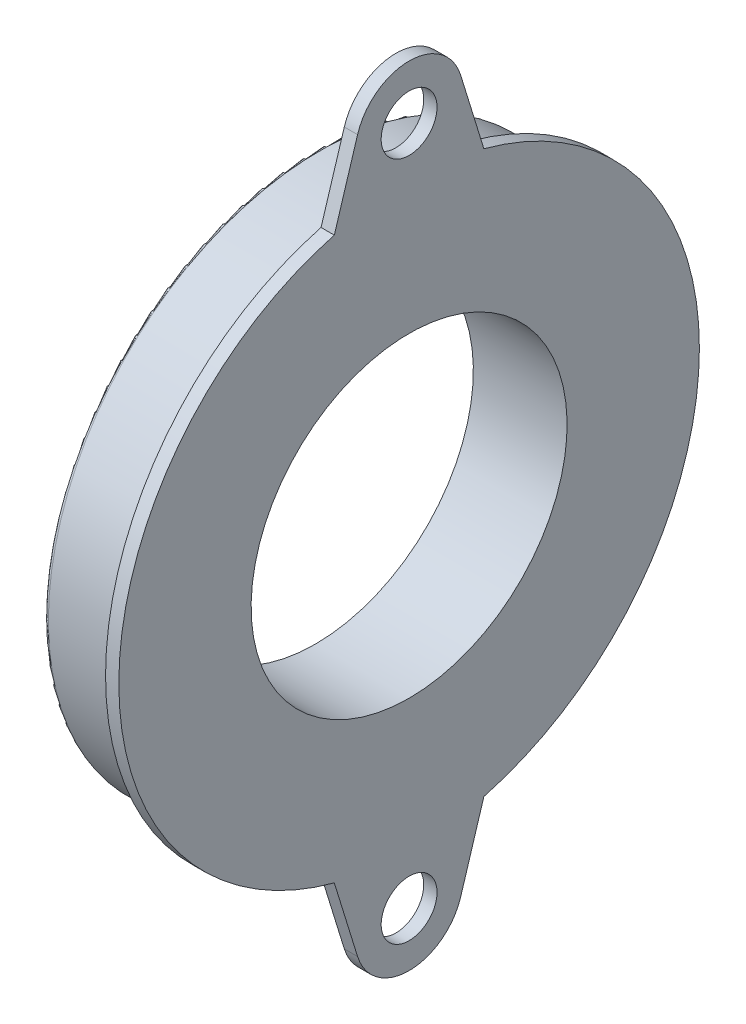
ISO-10303-21;
HEADER;
FILE_DESCRIPTION(('STEP AP214'),'2;1');
FILE_NAME('part.step','',(''),(''),'','','');
FILE_SCHEMA(('AUTOMOTIVE_DESIGN { 1 0 10303 214 1 1 1 1 }'));
ENDSEC;
DATA;
#1=APPLICATION_CONTEXT('core data for automotive mechanical design processes');
#2=APPLICATION_PROTOCOL_DEFINITION('international standard','automotive_design',2000,#1);
#3=PRODUCT_CONTEXT('',#1,'mechanical');
#4=PRODUCT('Part','Part','',(#3));
#5=PRODUCT_RELATED_PRODUCT_CATEGORY('part','',(#4));
#6=PRODUCT_DEFINITION_FORMATION('','',#4);
#7=PRODUCT_DEFINITION_CONTEXT('part definition',#1,'design');
#8=PRODUCT_DEFINITION('design','',#6,#7);
#9=PRODUCT_DEFINITION_SHAPE('','',#8);
#10=(LENGTH_UNIT() NAMED_UNIT(*) SI_UNIT(.MILLI.,.METRE.));
#11=(NAMED_UNIT(*) PLANE_ANGLE_UNIT() SI_UNIT($,.RADIAN.));
#12=(NAMED_UNIT(*) SI_UNIT($,.STERADIAN.) SOLID_ANGLE_UNIT());
#13=UNCERTAINTY_MEASURE_WITH_UNIT(LENGTH_MEASURE(1.E-05),#10,'distance_accuracy_value','');
#14=(GEOMETRIC_REPRESENTATION_CONTEXT(3) GLOBAL_UNCERTAINTY_ASSIGNED_CONTEXT((#13)) GLOBAL_UNIT_ASSIGNED_CONTEXT((#10,
#11,#12)) REPRESENTATION_CONTEXT('',''));
#15=CARTESIAN_POINT('',(0.,0.,0.));
#16=DIRECTION('',(0.,0.,1.));
#17=DIRECTION('',(1.,0.,0.));
#18=AXIS2_PLACEMENT_3D('',#15,#16,#17);
#19=CARTESIAN_POINT('',(-166.7002,-94.8054117549614,1701.53821105677));
#20=DIRECTION('',(0.,-0.294643766699233,0.955607163402037));
#21=DIRECTION('',(0.,-0.955607163402037,-0.294643766699233));
#22=AXIS2_PLACEMENT_3D('',#19,#20,#21);
#23=PLANE('',#22);
#24=DIRECTION('',(0.,-0.955607163402037,-0.294643766699233));
#25=VECTOR('',#24,1.);
#26=CARTESIAN_POINT('',(-165.1,-94.8054117549614,1701.53821105677));
#27=LINE('',#26,#25);
#28=CARTESIAN_POINT('',(-165.1,-33.8197828561924,1720.342));
#29=VERTEX_POINT('',#28);
#30=CARTESIAN_POINT('',(-165.1,-42.911491628585,1717.5387400193));
#31=VERTEX_POINT('',#30);
#32=EDGE_CURVE('E248',#29,#31,#27,.T.);
#33=ORIENTED_EDGE('',*,*,#32,.F.);
#34=DIRECTION('',(1.,0.,0.));
#35=VECTOR('',#34,1.);
#36=CARTESIAN_POINT('',(-166.7002,-33.8197828561924,1720.342));
#37=LINE('',#36,#35);
#38=CARTESIAN_POINT('',(-166.7002,-33.8197828561924,1720.342));
#39=VERTEX_POINT('',#38);
#40=EDGE_CURVE('E86',#39,#29,#37,.T.);
#41=ORIENTED_EDGE('',*,*,#40,.F.);
#42=DIRECTION('',(0.,-0.955607163402037,-0.294643766699233));
#43=VECTOR('',#42,1.);
#44=CARTESIAN_POINT('',(-166.7002,-94.8054117549614,1701.53821105677));
#45=LINE('',#44,#43);
#46=CARTESIAN_POINT('',(-166.7002,-42.911491628585,1717.5387400193));
#47=VERTEX_POINT('',#46);
#48=EDGE_CURVE('E256',#39,#47,#45,.T.);
#49=ORIENTED_EDGE('',*,*,#48,.T.);
#50=DIRECTION('',(1.,0.,0.));
#51=VECTOR('',#50,1.);
#52=CARTESIAN_POINT('',(-166.7002,-42.911491628585,1717.5387400193));
#53=LINE('',#52,#51);
#54=EDGE_CURVE('E39',#47,#31,#53,.T.);
#55=ORIENTED_EDGE('',*,*,#54,.T.);
#56=EDGE_LOOP('',(#33,#41,#49,#55));
#57=FACE_BOUND('',#56,.T.);
#58=ADVANCED_FACE('F16',(#57),#23,.T.);
#59=CARTESIAN_POINT('',(-166.7002,0.,1711.325));
#60=DIRECTION('',(1.,0.,0.));
#61=DIRECTION('',(0.,0.,-1.));
#62=AXIS2_PLACEMENT_3D('',#59,#60,#61);
#63=CYLINDRICAL_SURFACE('',#62,35.0012);
#64=CARTESIAN_POINT('',(-165.1,0.,1711.325));
#65=DIRECTION('',(-1.,0.,0.));
#66=DIRECTION('',(0.,-0.966246381729549,0.257619738751816));
#67=AXIS2_PLACEMENT_3D('',#64,#65,#66);
#68=CIRCLE('',#67,35.0012);
#69=CARTESIAN_POINT('',(-165.1,33.8197828561922,1720.342));
#70=VERTEX_POINT('',#69);
#71=EDGE_CURVE('E277',#29,#70,#68,.T.);
#72=ORIENTED_EDGE('',*,*,#71,.T.);
#73=DIRECTION('',(1.,0.,0.));
#74=VECTOR('',#73,1.);
#75=CARTESIAN_POINT('',(-166.7002,33.8197828561922,1720.342));
#76=LINE('',#75,#74);
#77=CARTESIAN_POINT('',(-166.7002,33.8197828561922,1720.342));
#78=VERTEX_POINT('',#77);
#79=EDGE_CURVE('E149',#78,#70,#76,.T.);
#80=ORIENTED_EDGE('',*,*,#79,.F.);
#81=CARTESIAN_POINT('',(-166.7002,0.,1711.325));
#82=DIRECTION('',(-1.,0.,0.));
#83=DIRECTION('',(0.,-0.966246381729549,0.257619738751816));
#84=AXIS2_PLACEMENT_3D('',#81,#82,#83);
#85=CIRCLE('',#84,35.0012);
#86=EDGE_CURVE('E260',#39,#78,#85,.T.);
#87=ORIENTED_EDGE('',*,*,#86,.F.);
#88=ORIENTED_EDGE('',*,*,#40,.T.);
#89=EDGE_LOOP('',(#72,#80,#87,#88));
#90=FACE_BOUND('',#89,.T.);
#91=ADVANCED_FACE('F186',(#90),#63,.T.);
#92=CARTESIAN_POINT('',(-166.7002,38.4856338406995,1718.90337128144));
#93=DIRECTION('',(0.,-0.294643766699233,-0.955607163402037));
#94=DIRECTION('',(0.,0.955607163402037,-0.294643766699233));
#95=AXIS2_PLACEMENT_3D('',#92,#93,#94);
#96=PLANE('',#95);
#97=DIRECTION('',(0.,0.955607163402037,-0.294643766699233));
#98=VECTOR('',#97,1.);
#99=CARTESIAN_POINT('',(-165.1,38.4856338406995,1718.90337128144));
#100=LINE('',#99,#98);
#101=CARTESIAN_POINT('',(-165.1,42.911491628585,1717.5387400193));
#102=VERTEX_POINT('',#101);
#103=EDGE_CURVE('E281',#70,#102,#100,.T.);
#104=ORIENTED_EDGE('',*,*,#103,.T.);
#105=DIRECTION('',(1.,0.,0.));
#106=VECTOR('',#105,1.);
#107=CARTESIAN_POINT('',(-166.7002,42.911491628585,1717.5387400193));
#108=LINE('',#107,#106);
#109=CARTESIAN_POINT('',(-166.7002,42.911491628585,1717.5387400193));
#110=VERTEX_POINT('',#109);
#111=EDGE_CURVE('E146',#110,#102,#108,.T.);
#112=ORIENTED_EDGE('',*,*,#111,.F.);
#113=DIRECTION('',(0.,0.955607163402037,-0.294643766699233));
#114=VECTOR('',#113,1.);
#115=CARTESIAN_POINT('',(-166.7002,38.4856338406995,1718.90337128144));
#116=LINE('',#115,#114);
#117=EDGE_CURVE('E264',#78,#110,#116,.T.);
#118=ORIENTED_EDGE('',*,*,#117,.F.);
#119=ORIENTED_EDGE('',*,*,#79,.T.);
#120=EDGE_LOOP('',(#104,#112,#118,#119));
#121=FACE_BOUND('',#120,.T.);
#122=ADVANCED_FACE('F190',(#121),#96,.F.);
#123=CARTESIAN_POINT('',(-166.7002,40.9956,1711.325));
#124=DIRECTION('',(1.,0.,0.));
#125=DIRECTION('',(0.,0.,-1.));
#126=AXIS2_PLACEMENT_3D('',#123,#124,#125);
#127=CYLINDRICAL_SURFACE('',#126,6.5024);
#128=CARTESIAN_POINT('',(-165.1,40.9956,1711.325));
#129=DIRECTION('',(-1.,0.,0.));
#130=DIRECTION('',(0.,0.294643766699231,0.955607163402038));
#131=AXIS2_PLACEMENT_3D('',#128,#129,#130);
#132=CIRCLE('',#131,6.5024);
#133=CARTESIAN_POINT('',(-165.1,42.911491628585,1705.11125998069));
#134=VERTEX_POINT('',#133);
#135=EDGE_CURVE('E285',#102,#134,#132,.T.);
#136=ORIENTED_EDGE('',*,*,#135,.T.);
#137=DIRECTION('',(1.,0.,0.));
#138=VECTOR('',#137,1.);
#139=CARTESIAN_POINT('',(-166.7002,42.911491628585,1705.11125998069));
#140=LINE('',#139,#138);
#141=CARTESIAN_POINT('',(-166.7002,42.911491628585,1705.11125998069));
#142=VERTEX_POINT('',#141);
#143=EDGE_CURVE('E138',#142,#134,#140,.T.);
#144=ORIENTED_EDGE('',*,*,#143,.F.);
#145=CARTESIAN_POINT('',(-166.7002,40.9956,1711.325));
#146=DIRECTION('',(-1.,0.,0.));
#147=DIRECTION('',(0.,0.294643766699231,0.955607163402038));
#148=AXIS2_PLACEMENT_3D('',#145,#146,#147);
#149=CIRCLE('',#148,6.5024);
#150=EDGE_CURVE('E268',#110,#142,#149,.T.);
#151=ORIENTED_EDGE('',*,*,#150,.F.);
#152=ORIENTED_EDGE('',*,*,#111,.T.);
#153=EDGE_LOOP('',(#136,#144,#151,#152));
#154=FACE_BOUND('',#153,.T.);
#155=ADVANCED_FACE('F196',(#154),#127,.T.);
#156=CARTESIAN_POINT('',(-166.7002,36.776257612061,1703.21957422379));
#157=DIRECTION('',(0.,0.29464376669919,-0.95560716340205));
#158=DIRECTION('',(0.,0.95560716340205,0.29464376669919));
#159=AXIS2_PLACEMENT_3D('',#156,#157,#158);
#160=PLANE('',#159);
#161=DIRECTION('',(0.,0.95560716340205,0.29464376669919));
#162=VECTOR('',#161,1.);
#163=CARTESIAN_POINT('',(-165.1,36.776257612061,1703.21957422379));
#164=LINE('',#163,#162);
#165=CARTESIAN_POINT('',(-165.1,33.8197828561923,1702.308));
#166=VERTEX_POINT('',#165);
#167=EDGE_CURVE('E289',#166,#134,#164,.T.);
#168=ORIENTED_EDGE('',*,*,#167,.F.);
#169=DIRECTION('',(1.,0.,0.));
#170=VECTOR('',#169,1.);
#171=CARTESIAN_POINT('',(-166.7002,33.8197828561923,1702.308));
#172=LINE('',#171,#170);
#173=CARTESIAN_POINT('',(-166.7002,33.8197828561923,1702.308));
#174=VERTEX_POINT('',#173);
#175=EDGE_CURVE('E133',#174,#166,#172,.T.);
#176=ORIENTED_EDGE('',*,*,#175,.F.);
#177=DIRECTION('',(0.,0.95560716340205,0.29464376669919));
#178=VECTOR('',#177,1.);
#179=CARTESIAN_POINT('',(-166.7002,36.776257612061,1703.21957422379));
#180=LINE('',#179,#178);
#181=EDGE_CURVE('E125',#174,#142,#180,.T.);
#182=ORIENTED_EDGE('',*,*,#181,.T.);
#183=ORIENTED_EDGE('',*,*,#143,.T.);
#184=EDGE_LOOP('',(#168,#176,#182,#183));
#185=FACE_BOUND('',#184,.T.);
#186=ADVANCED_FACE('F200',(#185),#160,.T.);
#187=CARTESIAN_POINT('',(-166.7002,0.,1711.325));
#188=DIRECTION('',(1.,0.,0.));
#189=DIRECTION('',(0.,0.,-1.));
#190=AXIS2_PLACEMENT_3D('',#187,#188,#189);
#191=CYLINDRICAL_SURFACE('',#190,35.0012);
#192=CARTESIAN_POINT('',(-165.1,0.,1711.325));
#193=DIRECTION('',(-1.,0.,0.));
#194=DIRECTION('',(0.,0.96624638172955,-0.257619738751815));
#195=AXIS2_PLACEMENT_3D('',#192,#193,#194);
#196=CIRCLE('',#195,35.0012);
#197=CARTESIAN_POINT('',(-165.1,-33.8197828561924,1702.308));
#198=VERTEX_POINT('',#197);
#199=EDGE_CURVE('E131',#166,#198,#196,.T.);
#200=ORIENTED_EDGE('',*,*,#199,.T.);
#201=DIRECTION('',(1.,0.,0.));
#202=VECTOR('',#201,1.);
#203=CARTESIAN_POINT('',(-166.7002,-33.8197828561924,1702.308));
#204=LINE('',#203,#202);
#205=CARTESIAN_POINT('',(-166.7002,-33.8197828561924,1702.308));
#206=VERTEX_POINT('',#205);
#207=EDGE_CURVE('E112',#206,#198,#204,.T.);
#208=ORIENTED_EDGE('',*,*,#207,.F.);
#209=CARTESIAN_POINT('',(-166.7002,0.,1711.325));
#210=DIRECTION('',(-1.,0.,0.));
#211=DIRECTION('',(0.,0.96624638172955,-0.257619738751815));
#212=AXIS2_PLACEMENT_3D('',#209,#210,#211);
#213=CIRCLE('',#212,35.0012);
#214=EDGE_CURVE('E118',#174,#206,#213,.T.);
#215=ORIENTED_EDGE('',*,*,#214,.F.);
#216=ORIENTED_EDGE('',*,*,#175,.T.);
#217=EDGE_LOOP('',(#200,#208,#215,#216));
#218=FACE_BOUND('',#217,.T.);
#219=ADVANCED_FACE('F129',(#218),#191,.T.);
#220=CARTESIAN_POINT('',(-166.7002,19.5435203021932,1685.85441399911));
#221=DIRECTION('',(0.,0.29464376669919,0.95560716340205));
#222=DIRECTION('',(0.,-0.95560716340205,0.29464376669919));
#223=AXIS2_PLACEMENT_3D('',#220,#221,#222);
#224=PLANE('',#223);
#225=DIRECTION('',(0.,-0.95560716340205,0.29464376669919));
#226=VECTOR('',#225,1.);
#227=CARTESIAN_POINT('',(-165.1,19.5435203021932,1685.85441399911));
#228=LINE('',#227,#226);
#229=CARTESIAN_POINT('',(-165.1,-42.911491628585,1705.11125998069));
#230=VERTEX_POINT('',#229);
#231=EDGE_CURVE('E295',#198,#230,#228,.T.);
#232=ORIENTED_EDGE('',*,*,#231,.T.);
#233=DIRECTION('',(1.,0.,0.));
#234=VECTOR('',#233,1.);
#235=CARTESIAN_POINT('',(-166.7002,-42.911491628585,1705.11125998069));
#236=LINE('',#235,#234);
#237=CARTESIAN_POINT('',(-166.7002,-42.911491628585,1705.11125998069));
#238=VERTEX_POINT('',#237);
#239=EDGE_CURVE('E74',#238,#230,#236,.T.);
#240=ORIENTED_EDGE('',*,*,#239,.F.);
#241=DIRECTION('',(0.,-0.95560716340205,0.29464376669919));
#242=VECTOR('',#241,1.);
#243=CARTESIAN_POINT('',(-166.7002,19.5435203021932,1685.85441399911));
#244=LINE('',#243,#242);
#245=EDGE_CURVE('E108',#206,#238,#244,.T.);
#246=ORIENTED_EDGE('',*,*,#245,.F.);
#247=ORIENTED_EDGE('',*,*,#207,.T.);
#248=EDGE_LOOP('',(#232,#240,#246,#247));
#249=FACE_BOUND('',#248,.T.);
#250=ADVANCED_FACE('F110',(#249),#224,.F.);
#251=CARTESIAN_POINT('',(-166.7002,-40.9956,1711.325));
#252=DIRECTION('',(1.,0.,0.));
#253=DIRECTION('',(0.,0.,-1.));
#254=AXIS2_PLACEMENT_3D('',#251,#252,#253);
#255=CYLINDRICAL_SURFACE('',#254,6.5024);
#256=CARTESIAN_POINT('',(-165.1,-40.9956,1711.325));
#257=DIRECTION('',(1.,0.,0.));
#258=DIRECTION('',(0.,-0.294643766699231,0.955607163402038));
#259=AXIS2_PLACEMENT_3D('',#256,#257,#258);
#260=CIRCLE('',#259,6.5024);
#261=EDGE_CURVE('E257',#31,#230,#260,.T.);
#262=ORIENTED_EDGE('',*,*,#261,.F.);
#263=ORIENTED_EDGE('',*,*,#54,.F.);
#264=CARTESIAN_POINT('',(-166.7002,-40.9956,1711.325));
#265=DIRECTION('',(1.,0.,0.));
#266=DIRECTION('',(0.,-0.294643766699231,0.955607163402038));
#267=AXIS2_PLACEMENT_3D('',#264,#265,#266);
#268=CIRCLE('',#267,6.5024);
#269=EDGE_CURVE('E117',#47,#238,#268,.T.);
#270=ORIENTED_EDGE('',*,*,#269,.T.);
#271=ORIENTED_EDGE('',*,*,#239,.T.);
#272=EDGE_LOOP('',(#262,#263,#270,#271));
#273=FACE_BOUND('',#272,.T.);
#274=ADVANCED_FACE('F209',(#273),#255,.T.);
#275=CARTESIAN_POINT('',(-166.7002,0.,1711.325));
#276=DIRECTION('',(-1.,0.,0.));
#277=DIRECTION('',(0.,-1.,0.));
#278=AXIS2_PLACEMENT_3D('',#275,#276,#277);
#279=PLANE('',#278);
#280=CARTESIAN_POINT('',(-166.7002,-40.9956,1711.325));
#281=DIRECTION('',(-1.,0.,0.));
#282=DIRECTION('',(0.,0.,1.));
#283=AXIS2_PLACEMENT_3D('',#280,#281,#282);
#284=CIRCLE('',#283,3.36549999999991);
#285=CARTESIAN_POINT('',(-166.7002,-40.9956,1714.6905));
#286=VERTEX_POINT('',#285);
#287=EDGE_CURVE('E161',#286,#286,#284,.F.);
#288=ORIENTED_EDGE('',*,*,#287,.T.);
#289=EDGE_LOOP('',(#288));
#290=FACE_BOUND('',#289,.T.);
#291=CARTESIAN_POINT('',(-166.7002,40.9956,1711.325));
#292=DIRECTION('',(-1.,0.,0.));
#293=DIRECTION('',(0.,0.,1.));
#294=AXIS2_PLACEMENT_3D('',#291,#292,#293);
#295=CIRCLE('',#294,3.36549999999991);
#296=CARTESIAN_POINT('',(-166.7002,40.9956,1714.6905));
#297=VERTEX_POINT('',#296);
#298=EDGE_CURVE('E155',#297,#297,#295,.F.);
#299=ORIENTED_EDGE('',*,*,#298,.T.);
#300=EDGE_LOOP('',(#299));
#301=FACE_BOUND('',#300,.T.);
#302=CARTESIAN_POINT('',(-166.7002,0.,1711.325));
#303=DIRECTION('',(-1.,0.,0.));
#304=DIRECTION('',(0.,-1.,0.));
#305=AXIS2_PLACEMENT_3D('',#302,#303,#304);
#306=CIRCLE('',#305,32.7025);
#307=CARTESIAN_POINT('',(-166.7002,-32.7025000000001,1711.325));
#308=VERTEX_POINT('',#307);
#309=EDGE_CURVE('E252',#308,#308,#306,.T.);
#310=ORIENTED_EDGE('',*,*,#309,.F.);
#311=EDGE_LOOP('',(#310));
#312=FACE_BOUND('',#311,.T.);
#313=ORIENTED_EDGE('',*,*,#48,.F.);
#314=ORIENTED_EDGE('',*,*,#86,.T.);
#315=ORIENTED_EDGE('',*,*,#117,.T.);
#316=ORIENTED_EDGE('',*,*,#150,.T.);
#317=ORIENTED_EDGE('',*,*,#181,.F.);
#318=ORIENTED_EDGE('',*,*,#214,.T.);
#319=ORIENTED_EDGE('',*,*,#245,.T.);
#320=ORIENTED_EDGE('',*,*,#269,.F.);
#321=EDGE_LOOP('',(#313,#314,#315,#316,#317,#318,#319,#320));
#322=FACE_BOUND('',#321,.T.);
#323=ADVANCED_FACE('F123',(#290,#301,#312,#322),#279,.T.);
#324=CARTESIAN_POINT('',(-165.1,0.,1711.325));
#325=DIRECTION('',(-1.,0.,0.));
#326=DIRECTION('',(0.,-1.,0.));
#327=AXIS2_PLACEMENT_3D('',#324,#325,#326);
#328=PLANE('',#327);
#329=CARTESIAN_POINT('',(-165.1,-40.9956,1711.325));
#330=DIRECTION('',(1.,0.,0.));
#331=DIRECTION('',(0.,0.,-1.));
#332=AXIS2_PLACEMENT_3D('',#329,#330,#331);
#333=CIRCLE('',#332,3.36549999999991);
#334=CARTESIAN_POINT('',(-165.1,-40.9956,1707.9595));
#335=VERTEX_POINT('',#334);
#336=EDGE_CURVE('E164',#335,#335,#333,.T.);
#337=ORIENTED_EDGE('',*,*,#336,.F.);
#338=EDGE_LOOP('',(#337));
#339=FACE_BOUND('',#338,.T.);
#340=CARTESIAN_POINT('',(-165.1,40.9956,1711.325));
#341=DIRECTION('',(1.,0.,0.));
#342=DIRECTION('',(0.,0.,-1.));
#343=AXIS2_PLACEMENT_3D('',#340,#341,#342);
#344=CIRCLE('',#343,3.36549999999991);
#345=CARTESIAN_POINT('',(-165.1,40.9956,1707.9595));
#346=VERTEX_POINT('',#345);
#347=EDGE_CURVE('E160',#346,#346,#344,.T.);
#348=ORIENTED_EDGE('',*,*,#347,.F.);
#349=EDGE_LOOP('',(#348));
#350=FACE_BOUND('',#349,.T.);
#351=ORIENTED_EDGE('',*,*,#32,.T.);
#352=ORIENTED_EDGE('',*,*,#261,.T.);
#353=ORIENTED_EDGE('',*,*,#231,.F.);
#354=ORIENTED_EDGE('',*,*,#199,.F.);
#355=ORIENTED_EDGE('',*,*,#167,.T.);
#356=ORIENTED_EDGE('',*,*,#135,.F.);
#357=ORIENTED_EDGE('',*,*,#103,.F.);
#358=ORIENTED_EDGE('',*,*,#71,.F.);
#359=EDGE_LOOP('',(#351,#352,#353,#354,#355,#356,#357,#358));
#360=FACE_BOUND('',#359,.T.);
#361=CARTESIAN_POINT('',(-165.1,0.,1711.325));
#362=DIRECTION('',(-1.,0.,0.));
#363=DIRECTION('',(0.,-1.,0.));
#364=AXIS2_PLACEMENT_3D('',#361,#362,#363);
#365=CIRCLE('',#364,19.05);
#366=CARTESIAN_POINT('',(-165.1,-19.0500000000001,1711.325));
#367=VERTEX_POINT('',#366);
#368=EDGE_CURVE('E159',#367,#367,#365,.T.);
#369=ORIENTED_EDGE('',*,*,#368,.T.);
#370=EDGE_LOOP('',(#369));
#371=FACE_BOUND('',#370,.T.);
#372=ADVANCED_FACE('F212',(#339,#350,#360,#371),#328,.F.);
#373=CARTESIAN_POINT('',(-176.403,0.,1711.325));
#374=DIRECTION('',(1.,0.,0.));
#375=DIRECTION('',(0.,0.,-1.));
#376=AXIS2_PLACEMENT_3D('',#373,#374,#375);
#377=CYLINDRICAL_SURFACE('',#376,32.7025);
#378=CARTESIAN_POINT('',(-175.895,0.,1711.325));
#379=DIRECTION('',(-1.,0.,0.));
#380=DIRECTION('',(0.,0.,1.));
#381=AXIS2_PLACEMENT_3D('',#378,#379,#380);
#382=CIRCLE('',#381,32.7025);
#383=CARTESIAN_POINT('',(-175.895,0.,1744.0275));
#384=VERTEX_POINT('',#383);
#385=EDGE_CURVE('E11',#384,#384,#382,.F.);
#386=ORIENTED_EDGE('',*,*,#385,.T.);
#387=EDGE_LOOP('',(#386));
#388=FACE_BOUND('',#387,.T.);
#389=ORIENTED_EDGE('',*,*,#309,.T.);
#390=EDGE_LOOP('',(#389));
#391=FACE_BOUND('',#390,.T.);
#392=ADVANCED_FACE('F215',(#388,#391),#377,.T.);
#393=CARTESIAN_POINT('',(-176.403,0.,1711.325));
#394=DIRECTION('',(1.,0.,0.));
#395=DIRECTION('',(0.,0.,-1.));
#396=AXIS2_PLACEMENT_3D('',#393,#394,#395);
#397=CYLINDRICAL_SURFACE('',#396,19.05);
#398=CARTESIAN_POINT('',(-176.403,0.,1711.325));
#399=DIRECTION('',(-1.,0.,0.));
#400=DIRECTION('',(0.,-1.,0.));
#401=AXIS2_PLACEMENT_3D('',#398,#399,#400);
#402=CIRCLE('',#401,19.05);
#403=CARTESIAN_POINT('',(-176.403,-19.0500000000001,1711.325));
#404=VERTEX_POINT('',#403);
#405=EDGE_CURVE('E244',#404,#404,#402,.T.);
#406=ORIENTED_EDGE('',*,*,#405,.T.);
#407=EDGE_LOOP('',(#406));
#408=FACE_BOUND('',#407,.T.);
#409=ORIENTED_EDGE('',*,*,#368,.F.);
#410=EDGE_LOOP('',(#409));
#411=FACE_BOUND('',#410,.T.);
#412=ADVANCED_FACE('F220',(#408,#411),#397,.F.);
#413=CARTESIAN_POINT('',(-176.403,0.,1711.325));
#414=DIRECTION('',(-1.,0.,0.));
#415=DIRECTION('',(0.,-1.,0.));
#416=AXIS2_PLACEMENT_3D('',#413,#414,#415);
#417=PLANE('',#416);
#418=CARTESIAN_POINT('',(-176.403,0.,1711.325));
#419=DIRECTION('',(-1.,0.,0.));
#420=DIRECTION('',(0.,0.,1.));
#421=AXIS2_PLACEMENT_3D('',#418,#419,#420);
#422=CIRCLE('',#421,32.1945);
#423=CARTESIAN_POINT('',(-176.403,0.,1743.5195));
#424=VERTEX_POINT('',#423);
#425=EDGE_CURVE('E26',#424,#424,#422,.T.);
#426=ORIENTED_EDGE('',*,*,#425,.T.);
#427=EDGE_LOOP('',(#426));
#428=FACE_BOUND('',#427,.T.);
#429=ORIENTED_EDGE('',*,*,#405,.F.);
#430=EDGE_LOOP('',(#429));
#431=FACE_BOUND('',#430,.T.);
#432=ADVANCED_FACE('F171',(#428,#431),#417,.T.);
#433=CARTESIAN_POINT('',(-284.653638380059,40.9956,1711.325));
#434=DIRECTION('',(1.,0.,0.));
#435=DIRECTION('',(0.,0.,-1.));
#436=AXIS2_PLACEMENT_3D('',#433,#434,#435);
#437=CYLINDRICAL_SURFACE('',#436,3.36549999999991);
#438=ORIENTED_EDGE('',*,*,#298,.F.);
#439=EDGE_LOOP('',(#438));
#440=FACE_BOUND('',#439,.T.);
#441=ORIENTED_EDGE('',*,*,#347,.T.);
#442=EDGE_LOOP('',(#441));
#443=FACE_BOUND('',#442,.T.);
#444=ADVANCED_FACE('F181',(#440,#443),#437,.F.);
#445=CARTESIAN_POINT('',(-284.653638380059,-40.9956,1711.325));
#446=DIRECTION('',(1.,0.,0.));
#447=DIRECTION('',(0.,0.,-1.));
#448=AXIS2_PLACEMENT_3D('',#445,#446,#447);
#449=CYLINDRICAL_SURFACE('',#448,3.36549999999991);
#450=ORIENTED_EDGE('',*,*,#287,.F.);
#451=EDGE_LOOP('',(#450));
#452=FACE_BOUND('',#451,.T.);
#453=ORIENTED_EDGE('',*,*,#336,.T.);
#454=EDGE_LOOP('',(#453));
#455=FACE_BOUND('',#454,.T.);
#456=ADVANCED_FACE('F175',(#452,#455),#449,.F.);
#457=CARTESIAN_POINT('',(-175.895,0.,1711.325));
#458=DIRECTION('',(-1.,0.,0.));
#459=DIRECTION('',(0.,0.,1.));
#460=AXIS2_PLACEMENT_3D('',#457,#458,#459);
#461=TOROIDAL_SURFACE('',#460,32.1945,0.508);
#462=ORIENTED_EDGE('',*,*,#385,.F.);
#463=EDGE_LOOP('',(#462));
#464=FACE_BOUND('',#463,.T.);
#465=ORIENTED_EDGE('',*,*,#425,.F.);
#466=EDGE_LOOP('',(#465));
#467=FACE_BOUND('',#466,.T.);
#468=ADVANCED_FACE('F18',(#464,#467),#461,.T.);
#469=CLOSED_SHELL('',(#58,#91,#122,#155,#186,#219,#250,#274,#323,#372,#392,#412,#432,#444,#456,#468));
#470=MANIFOLD_SOLID_BREP('B1',#469);
#471=ADVANCED_BREP_SHAPE_REPRESENTATION('',(#18,#470),#14);
#472=SHAPE_DEFINITION_REPRESENTATION(#9,#471);
ENDSEC;
END-ISO-10303-21;
